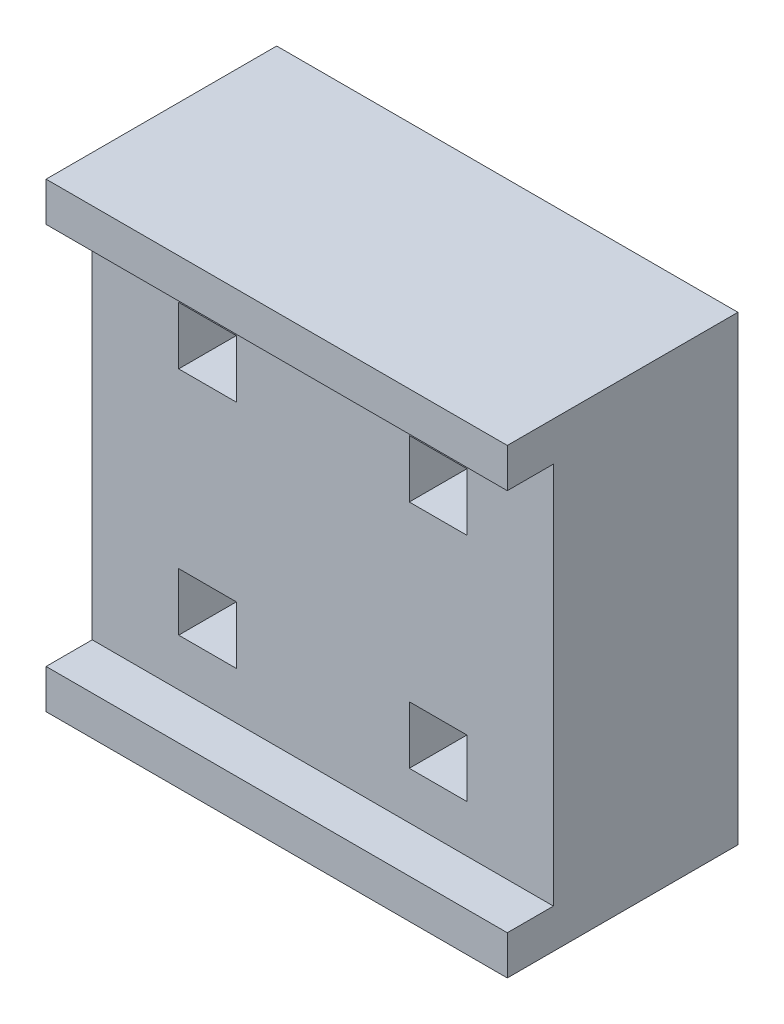
ISO-10303-21;
HEADER;
FILE_DESCRIPTION(('STEP AP214'),'2;1');
FILE_NAME('part.step','',(''),(''),'','','');
FILE_SCHEMA(('AUTOMOTIVE_DESIGN { 1 0 10303 214 1 1 1 1 }'));
ENDSEC;
DATA;
#1=APPLICATION_CONTEXT('core data for automotive mechanical design processes');
#2=APPLICATION_PROTOCOL_DEFINITION('international standard','automotive_design',2000,#1);
#3=PRODUCT_CONTEXT('',#1,'mechanical');
#4=PRODUCT('Part','Part','',(#3));
#5=PRODUCT_RELATED_PRODUCT_CATEGORY('part','',(#4));
#6=PRODUCT_DEFINITION_FORMATION('','',#4);
#7=PRODUCT_DEFINITION_CONTEXT('part definition',#1,'design');
#8=PRODUCT_DEFINITION('design','',#6,#7);
#9=PRODUCT_DEFINITION_SHAPE('','',#8);
#10=(LENGTH_UNIT() NAMED_UNIT(*) SI_UNIT(.MILLI.,.METRE.));
#11=(NAMED_UNIT(*) PLANE_ANGLE_UNIT() SI_UNIT($,.RADIAN.));
#12=(NAMED_UNIT(*) SI_UNIT($,.STERADIAN.) SOLID_ANGLE_UNIT());
#13=UNCERTAINTY_MEASURE_WITH_UNIT(LENGTH_MEASURE(1.E-05),#10,'distance_accuracy_value','');
#14=(GEOMETRIC_REPRESENTATION_CONTEXT(3) GLOBAL_UNCERTAINTY_ASSIGNED_CONTEXT((#13)) GLOBAL_UNIT_ASSIGNED_CONTEXT((#10,
#11,#12)) REPRESENTATION_CONTEXT('',''));
#15=CARTESIAN_POINT('',(0.,0.,0.));
#16=DIRECTION('',(0.,0.,1.));
#17=DIRECTION('',(1.,0.,0.));
#18=AXIS2_PLACEMENT_3D('',#15,#16,#17);
#19=CARTESIAN_POINT('',(0.000124023441458121,9.89966949484256E-05,6.33));
#20=DIRECTION('',(0.,-4.37113882867379E-08,1.));
#21=DIRECTION('',(0.,-1.,-4.37113882867379E-08));
#22=AXIS2_PLACEMENT_3D('',#19,#20,#21);
#23=PLANE('',#22);
#24=DIRECTION('',(1.,0.,0.));
#25=VECTOR('',#24,1.);
#26=CARTESIAN_POINT('',(-2.53987597655854,-2.10810100330505,6.32999990784765));
#27=LINE('',#26,#25);
#28=CARTESIAN_POINT('',(-2.53987597655854,-2.10810100330505,6.32999990784765));
#29=VERTEX_POINT('',#28);
#30=CARTESIAN_POINT('',(2.54012402344146,-2.10810100330505,6.32999990784765));
#31=VERTEX_POINT('',#30);
#32=EDGE_CURVE('E11',#29,#31,#27,.T.);
#33=ORIENTED_EDGE('',*,*,#32,.F.);
#34=DIRECTION('',(0.,-0.999999999999999,-4.37113882735736E-08));
#35=VECTOR('',#34,1.);
#36=CARTESIAN_POINT('',(-2.53987597655854,-2.10810100330505,6.32999990784765));
#37=LINE('',#36,#35);
#38=CARTESIAN_POINT('',(-2.53987597655854,-2.53990100330505,6.32999988897307));
#39=VERTEX_POINT('',#38);
#40=EDGE_CURVE('E368',#29,#39,#37,.T.);
#41=ORIENTED_EDGE('',*,*,#40,.T.);
#42=DIRECTION('',(1.,0.,0.));
#43=VECTOR('',#42,1.);
#44=CARTESIAN_POINT('',(-2.53987597655854,-2.53990100330505,6.32999988897307));
#45=LINE('',#44,#43);
#46=CARTESIAN_POINT('',(2.54012402344146,-2.53990100330505,6.32999988897307));
#47=VERTEX_POINT('',#46);
#48=EDGE_CURVE('E366',#39,#47,#45,.T.);
#49=ORIENTED_EDGE('',*,*,#48,.T.);
#50=DIRECTION('',(0.,0.999999999999999,4.37113882735736E-08));
#51=VECTOR('',#50,1.);
#52=CARTESIAN_POINT('',(2.54012402344146,-2.53990100330505,6.32999988897307));
#53=LINE('',#52,#51);
#54=EDGE_CURVE('E354',#47,#31,#53,.T.);
#55=ORIENTED_EDGE('',*,*,#54,.T.);
#56=EDGE_LOOP('',(#33,#41,#49,#55));
#57=FACE_BOUND('',#56,.T.);
#58=ADVANCED_FACE('F17',(#57),#23,.T.);
#59=CARTESIAN_POINT('',(-2.53987597655854,2.54009910772187,3.79000011102693));
#60=DIRECTION('',(-1.,0.,0.));
#61=DIRECTION('',(0.,-1.,-4.37113882867379E-08));
#62=AXIS2_PLACEMENT_3D('',#59,#60,#61);
#63=PLANE('',#62);
#64=DIRECTION('',(0.,4.37113897134182E-08,-0.999999999999999));
#65=VECTOR('',#64,1.);
#66=CARTESIAN_POINT('',(-2.53987597655854,-2.10810100330505,6.32999990784765));
#67=LINE('',#66,#65);
#68=CARTESIAN_POINT('',(-2.53987597655854,-2.10810098109967,5.82199990784765));
#69=VERTEX_POINT('',#68);
#70=EDGE_CURVE('E24',#29,#69,#67,.T.);
#71=ORIENTED_EDGE('',*,*,#70,.T.);
#72=DIRECTION('',(0.,0.999999999999999,4.37113881124894E-08));
#73=VECTOR('',#72,1.);
#74=CARTESIAN_POINT('',(-2.53987597655854,-2.10810098109967,5.82199990784765));
#75=LINE('',#74,#73);
#76=CARTESIAN_POINT('',(-2.53987597655854,2.10829901890033,5.82200009215235));
#77=VERTEX_POINT('',#76);
#78=EDGE_CURVE('E364',#69,#77,#75,.T.);
#79=ORIENTED_EDGE('',*,*,#78,.T.);
#80=DIRECTION('',(0.,-4.37113888392268E-08,0.999999999999999));
#81=VECTOR('',#80,1.);
#82=CARTESIAN_POINT('',(-2.53987597655854,2.10829901890033,5.82200009215235));
#83=LINE('',#82,#81);
#84=CARTESIAN_POINT('',(-2.53987597655854,2.10829899669495,6.33000009215235));
#85=VERTEX_POINT('',#84);
#86=EDGE_CURVE('E356',#77,#85,#83,.T.);
#87=ORIENTED_EDGE('',*,*,#86,.T.);
#88=DIRECTION('',(0.,-0.999999999999999,-4.37113882735736E-08));
#89=VECTOR('',#88,1.);
#90=CARTESIAN_POINT('',(-2.53987597655854,2.54009899669495,6.33000011102693));
#91=LINE('',#90,#89);
#92=CARTESIAN_POINT('',(-2.53987597655854,2.54009899669495,6.33000011102693));
#93=VERTEX_POINT('',#92);
#94=EDGE_CURVE('E347',#93,#85,#91,.T.);
#95=ORIENTED_EDGE('',*,*,#94,.F.);
#96=DIRECTION('',(0.,-4.3711388314712E-08,0.999999999999999));
#97=VECTOR('',#96,1.);
#98=CARTESIAN_POINT('',(-2.53987597655854,2.54009910772187,3.79000011102693));
#99=LINE('',#98,#97);
#100=CARTESIAN_POINT('',(-2.53987597655854,2.54009910772187,3.79000011102693));
#101=VERTEX_POINT('',#100);
#102=EDGE_CURVE('E337',#101,#93,#99,.T.);
#103=ORIENTED_EDGE('',*,*,#102,.F.);
#104=DIRECTION('',(0.,-0.999999999999999,-4.37113884895503E-08));
#105=VECTOR('',#104,1.);
#106=CARTESIAN_POINT('',(-2.53987597655854,2.54009910772187,3.79000011102693));
#107=LINE('',#106,#105);
#108=CARTESIAN_POINT('',(-2.53987597655854,-2.53990089227813,3.78999988897307));
#109=VERTEX_POINT('',#108);
#110=EDGE_CURVE('E324',#101,#109,#107,.T.);
#111=ORIENTED_EDGE('',*,*,#110,.T.);
#112=DIRECTION('',(0.,-4.3711388314712E-08,0.999999999999999));
#113=VECTOR('',#112,1.);
#114=CARTESIAN_POINT('',(-2.53987597655854,-2.53990089227813,3.78999988897307));
#115=LINE('',#114,#113);
#116=EDGE_CURVE('E358',#109,#39,#115,.T.);
#117=ORIENTED_EDGE('',*,*,#116,.T.);
#118=ORIENTED_EDGE('',*,*,#40,.F.);
#119=EDGE_LOOP('',(#71,#79,#87,#95,#103,#111,#117,#118));
#120=FACE_BOUND('',#119,.T.);
#121=ADVANCED_FACE('F374',(#120),#63,.T.);
#122=CARTESIAN_POINT('',(-2.53987597655854,-2.53990089227813,3.78999988897307));
#123=DIRECTION('',(0.,-1.,-4.37113882867379E-08));
#124=DIRECTION('',(1.,0.,0.));
#125=AXIS2_PLACEMENT_3D('',#122,#123,#124);
#126=PLANE('',#125);
#127=ORIENTED_EDGE('',*,*,#48,.F.);
#128=ORIENTED_EDGE('',*,*,#116,.F.);
#129=DIRECTION('',(1.,0.,0.));
#130=VECTOR('',#129,1.);
#131=CARTESIAN_POINT('',(-2.53987597655854,-2.53990089227813,3.78999988897307));
#132=LINE('',#131,#130);
#133=CARTESIAN_POINT('',(2.54012402344146,-2.53990089227813,3.78999988897307));
#134=VERTEX_POINT('',#133);
#135=EDGE_CURVE('E350',#109,#134,#132,.T.);
#136=ORIENTED_EDGE('',*,*,#135,.T.);
#137=DIRECTION('',(0.,-4.3711388314712E-08,0.999999999999999));
#138=VECTOR('',#137,1.);
#139=CARTESIAN_POINT('',(2.54012402344146,-2.53990089227813,3.78999988897307));
#140=LINE('',#139,#138);
#141=EDGE_CURVE('E340',#134,#47,#140,.T.);
#142=ORIENTED_EDGE('',*,*,#141,.T.);
#143=EDGE_LOOP('',(#127,#128,#136,#142));
#144=FACE_BOUND('',#143,.T.);
#145=ADVANCED_FACE('F372',(#144),#126,.T.);
#146=CARTESIAN_POINT('',(2.54012402344146,-2.53990089227813,3.78999988897307));
#147=DIRECTION('',(1.,0.,0.));
#148=DIRECTION('',(0.,1.,4.37113882867379E-08));
#149=AXIS2_PLACEMENT_3D('',#146,#147,#148);
#150=PLANE('',#149);
#151=DIRECTION('',(0.,4.37113897134182E-08,-0.999999999999999));
#152=VECTOR('',#151,1.);
#153=CARTESIAN_POINT('',(2.54012402344146,-2.10810100330505,6.32999990784765));
#154=LINE('',#153,#152);
#155=CARTESIAN_POINT('',(2.54012402344146,-2.10810098109967,5.82199990784765));
#156=VERTEX_POINT('',#155);
#157=EDGE_CURVE('E361',#31,#156,#154,.T.);
#158=ORIENTED_EDGE('',*,*,#157,.F.);
#159=ORIENTED_EDGE('',*,*,#54,.F.);
#160=ORIENTED_EDGE('',*,*,#141,.F.);
#161=DIRECTION('',(0.,0.999999999999999,4.37113881398737E-08));
#162=VECTOR('',#161,1.);
#163=CARTESIAN_POINT('',(2.54012402344146,-2.53990089227813,3.78999988897307));
#164=LINE('',#163,#162);
#165=CARTESIAN_POINT('',(2.54012402344146,2.54009910772187,3.79000011102693));
#166=VERTEX_POINT('',#165);
#167=EDGE_CURVE('E327',#134,#166,#164,.T.);
#168=ORIENTED_EDGE('',*,*,#167,.T.);
#169=DIRECTION('',(0.,-4.3711388314712E-08,0.999999999999999));
#170=VECTOR('',#169,1.);
#171=CARTESIAN_POINT('',(2.54012402344146,2.54009910772187,3.79000011102693));
#172=LINE('',#171,#170);
#173=CARTESIAN_POINT('',(2.54012402344146,2.54009899669495,6.33000011102693));
#174=VERTEX_POINT('',#173);
#175=EDGE_CURVE('E314',#166,#174,#172,.T.);
#176=ORIENTED_EDGE('',*,*,#175,.T.);
#177=DIRECTION('',(0.,0.999999999999999,4.37113882735736E-08));
#178=VECTOR('',#177,1.);
#179=CARTESIAN_POINT('',(2.54012402344146,2.10829899669495,6.33000009215235));
#180=LINE('',#179,#178);
#181=CARTESIAN_POINT('',(2.54012402344146,2.10829899669495,6.33000009215235));
#182=VERTEX_POINT('',#181);
#183=EDGE_CURVE('E304',#182,#174,#180,.T.);
#184=ORIENTED_EDGE('',*,*,#183,.F.);
#185=DIRECTION('',(0.,-4.37113888392268E-08,0.999999999999999));
#186=VECTOR('',#185,1.);
#187=CARTESIAN_POINT('',(2.54012402344146,2.10829901890033,5.82200009215235));
#188=LINE('',#187,#186);
#189=CARTESIAN_POINT('',(2.54012402344146,2.10829901890033,5.82200009215235));
#190=VERTEX_POINT('',#189);
#191=EDGE_CURVE('E290',#190,#182,#188,.T.);
#192=ORIENTED_EDGE('',*,*,#191,.F.);
#193=DIRECTION('',(0.,0.999999999999999,4.37113881124894E-08));
#194=VECTOR('',#193,1.);
#195=CARTESIAN_POINT('',(2.54012402344146,-2.10810098109967,5.82199990784765));
#196=LINE('',#195,#194);
#197=EDGE_CURVE('E279',#156,#190,#196,.T.);
#198=ORIENTED_EDGE('',*,*,#197,.F.);
#199=EDGE_LOOP('',(#158,#159,#160,#168,#176,#184,#192,#198));
#200=FACE_BOUND('',#199,.T.);
#201=ADVANCED_FACE('F382',(#200),#150,.T.);
#202=CARTESIAN_POINT('',(0.952624023441458,1.58759910772187,3.79000006939183));
#203=DIRECTION('',(-1.,0.,0.));
#204=DIRECTION('',(0.,-1.,-4.37113882867379E-08));
#205=AXIS2_PLACEMENT_3D('',#202,#203,#204);
#206=PLANE('',#205);
#207=DIRECTION('',(0.,-4.37113881835833E-08,0.999999999999999));
#208=VECTOR('',#207,1.);
#209=CARTESIAN_POINT('',(0.952624023441458,1.58759910772187,3.79000006939183));
#210=LINE('',#209,#208);
#211=CARTESIAN_POINT('',(0.952624023441458,1.58759910772187,3.79000006939183));
#212=VERTEX_POINT('',#211);
#213=CARTESIAN_POINT('',(0.952624023441458,1.58759901890033,5.82200006939183));
#214=VERTEX_POINT('',#213);
#215=EDGE_CURVE('E352',#212,#214,#210,.T.);
#216=ORIENTED_EDGE('',*,*,#215,.T.);
#217=DIRECTION('',(0.,-0.999999999999999,-4.37113890140651E-08));
#218=VECTOR('',#217,1.);
#219=CARTESIAN_POINT('',(0.952624023441458,1.58759901890033,5.82200006939183));
#220=LINE('',#219,#218);
#221=CARTESIAN_POINT('',(0.952624023441458,0.952599018900334,5.8220000416351));
#222=VERTEX_POINT('',#221);
#223=EDGE_CURVE('E343',#214,#222,#220,.T.);
#224=ORIENTED_EDGE('',*,*,#223,.T.);
#225=DIRECTION('',(0.,-4.37113882928572E-08,0.999999999999999));
#226=VECTOR('',#225,1.);
#227=CARTESIAN_POINT('',(0.952624023441458,0.952599107721875,3.7900000416351));
#228=LINE('',#227,#226);
#229=CARTESIAN_POINT('',(0.952624023441458,0.952599107721875,3.7900000416351));
#230=VERTEX_POINT('',#229);
#231=EDGE_CURVE('E329',#230,#222,#228,.T.);
#232=ORIENTED_EDGE('',*,*,#231,.F.);
#233=DIRECTION('',(0.,-0.999999999999999,-4.3711388314712E-08));
#234=VECTOR('',#233,1.);
#235=CARTESIAN_POINT('',(0.952624023441458,1.58759910772187,3.79000006939183));
#236=LINE('',#235,#234);
#237=EDGE_CURVE('E316',#212,#230,#236,.T.);
#238=ORIENTED_EDGE('',*,*,#237,.F.);
#239=EDGE_LOOP('',(#216,#224,#232,#238));
#240=FACE_BOUND('',#239,.T.);
#241=ADVANCED_FACE('F426',(#240),#206,.F.);
#242=CARTESIAN_POINT('',(1.58762402344146,1.58759910772187,3.79000006939183));
#243=DIRECTION('',(0.,1.,4.37113882867379E-08));
#244=DIRECTION('',(-1.,0.,0.));
#245=AXIS2_PLACEMENT_3D('',#242,#243,#244);
#246=PLANE('',#245);
#247=DIRECTION('',(0.,-4.37113881835833E-08,0.999999999999999));
#248=VECTOR('',#247,1.);
#249=CARTESIAN_POINT('',(1.58762402344146,1.58759910772187,3.79000006939183));
#250=LINE('',#249,#248);
#251=CARTESIAN_POINT('',(1.58762402344146,1.58759910772187,3.79000006939183));
#252=VERTEX_POINT('',#251);
#253=CARTESIAN_POINT('',(1.58762402344146,1.58759901890033,5.82200006939183));
#254=VERTEX_POINT('',#253);
#255=EDGE_CURVE('E345',#252,#254,#250,.T.);
#256=ORIENTED_EDGE('',*,*,#255,.T.);
#257=DIRECTION('',(-1.,0.,0.));
#258=VECTOR('',#257,1.);
#259=CARTESIAN_POINT('',(1.58762402344146,1.58759901890033,5.82200006939183));
#260=LINE('',#259,#258);
#261=EDGE_CURVE('E332',#254,#214,#260,.T.);
#262=ORIENTED_EDGE('',*,*,#261,.T.);
#263=ORIENTED_EDGE('',*,*,#215,.F.);
#264=DIRECTION('',(-1.,0.,0.));
#265=VECTOR('',#264,1.);
#266=CARTESIAN_POINT('',(1.58762402344146,1.58759910772187,3.79000006939183));
#267=LINE('',#266,#265);
#268=EDGE_CURVE('E307',#252,#212,#267,.T.);
#269=ORIENTED_EDGE('',*,*,#268,.F.);
#270=EDGE_LOOP('',(#256,#262,#263,#269));
#271=FACE_BOUND('',#270,.T.);
#272=ADVANCED_FACE('F431',(#271),#246,.F.);
#273=CARTESIAN_POINT('',(1.58762402344146,0.952599107721875,3.7900000416351));
#274=DIRECTION('',(1.,0.,0.));
#275=DIRECTION('',(0.,1.,4.37113882867379E-08));
#276=AXIS2_PLACEMENT_3D('',#273,#274,#275);
#277=PLANE('',#276);
#278=DIRECTION('',(0.,-4.37113882928572E-08,0.999999999999999));
#279=VECTOR('',#278,1.);
#280=CARTESIAN_POINT('',(1.58762402344146,0.952599107721875,3.7900000416351));
#281=LINE('',#280,#279);
#282=CARTESIAN_POINT('',(1.58762402344146,0.952599107721875,3.7900000416351));
#283=VERTEX_POINT('',#282);
#284=CARTESIAN_POINT('',(1.58762402344146,0.952599018900334,5.8220000416351));
#285=VERTEX_POINT('',#284);
#286=EDGE_CURVE('E335',#283,#285,#281,.T.);
#287=ORIENTED_EDGE('',*,*,#286,.T.);
#288=DIRECTION('',(0.,0.999999999999999,4.37113890140651E-08));
#289=VECTOR('',#288,1.);
#290=CARTESIAN_POINT('',(1.58762402344146,0.952599018900334,5.8220000416351));
#291=LINE('',#290,#289);
#292=EDGE_CURVE('E319',#285,#254,#291,.T.);
#293=ORIENTED_EDGE('',*,*,#292,.T.);
#294=ORIENTED_EDGE('',*,*,#255,.F.);
#295=DIRECTION('',(0.,0.999999999999999,4.3711388314712E-08));
#296=VECTOR('',#295,1.);
#297=CARTESIAN_POINT('',(1.58762402344146,0.952599107721875,3.7900000416351));
#298=LINE('',#297,#296);
#299=EDGE_CURVE('E293',#283,#252,#298,.T.);
#300=ORIENTED_EDGE('',*,*,#299,.F.);
#301=EDGE_LOOP('',(#287,#293,#294,#300));
#302=FACE_BOUND('',#301,.T.);
#303=ADVANCED_FACE('F436',(#302),#277,.F.);
#304=CARTESIAN_POINT('',(0.952624023441458,-0.952400892278125,3.7899999583649));
#305=DIRECTION('',(-1.,0.,0.));
#306=DIRECTION('',(0.,-1.,-4.37113882867379E-08));
#307=AXIS2_PLACEMENT_3D('',#304,#305,#306);
#308=PLANE('',#307);
#309=DIRECTION('',(0.,-4.37113882928572E-08,0.999999999999999));
#310=VECTOR('',#309,1.);
#311=CARTESIAN_POINT('',(0.952624023441458,-0.952400892278125,3.7899999583649));
#312=LINE('',#311,#310);
#313=CARTESIAN_POINT('',(0.952624023441458,-0.952400892278125,3.7899999583649));
#314=VERTEX_POINT('',#313);
#315=CARTESIAN_POINT('',(0.952624023441458,-0.952400981099666,5.8219999583649));
#316=VERTEX_POINT('',#315);
#317=EDGE_CURVE('E322',#314,#316,#312,.T.);
#318=ORIENTED_EDGE('',*,*,#317,.T.);
#319=DIRECTION('',(0.,-0.999999999999999,-4.37113890140651E-08));
#320=VECTOR('',#319,1.);
#321=CARTESIAN_POINT('',(0.952624023441458,-0.952400981099666,5.8219999583649));
#322=LINE('',#321,#320);
#323=CARTESIAN_POINT('',(0.952624023441458,-1.58740098109967,5.82199993060817));
#324=VERTEX_POINT('',#323);
#325=EDGE_CURVE('E310',#316,#324,#322,.T.);
#326=ORIENTED_EDGE('',*,*,#325,.T.);
#327=DIRECTION('',(0.,-4.37113884021311E-08,0.999999999999999));
#328=VECTOR('',#327,1.);
#329=CARTESIAN_POINT('',(0.952624023441458,-1.58740089227813,3.78999993060817));
#330=LINE('',#329,#328);
#331=CARTESIAN_POINT('',(0.952624023441458,-1.58740089227813,3.78999993060817));
#332=VERTEX_POINT('',#331);
#333=EDGE_CURVE('E296',#332,#324,#330,.T.);
#334=ORIENTED_EDGE('',*,*,#333,.F.);
#335=DIRECTION('',(0.,-0.999999999999999,-4.3711388314712E-08));
#336=VECTOR('',#335,1.);
#337=CARTESIAN_POINT('',(0.952624023441458,-0.952400892278125,3.7899999583649));
#338=LINE('',#337,#336);
#339=EDGE_CURVE('E282',#314,#332,#338,.T.);
#340=ORIENTED_EDGE('',*,*,#339,.F.);
#341=EDGE_LOOP('',(#318,#326,#334,#340));
#342=FACE_BOUND('',#341,.T.);
#343=ADVANCED_FACE('F441',(#342),#308,.F.);
#344=CARTESIAN_POINT('',(1.58762402344146,-0.952400892278125,3.7899999583649));
#345=DIRECTION('',(0.,1.,4.37113882867379E-08));
#346=DIRECTION('',(-1.,0.,0.));
#347=AXIS2_PLACEMENT_3D('',#344,#345,#346);
#348=PLANE('',#347);
#349=DIRECTION('',(0.,-4.37113882928572E-08,0.999999999999999));
#350=VECTOR('',#349,1.);
#351=CARTESIAN_POINT('',(1.58762402344146,-0.952400892278125,3.7899999583649));
#352=LINE('',#351,#350);
#353=CARTESIAN_POINT('',(1.58762402344146,-0.952400892278125,3.7899999583649));
#354=VERTEX_POINT('',#353);
#355=CARTESIAN_POINT('',(1.58762402344146,-0.952400981099666,5.8219999583649));
#356=VERTEX_POINT('',#355);
#357=EDGE_CURVE('E312',#354,#356,#352,.T.);
#358=ORIENTED_EDGE('',*,*,#357,.T.);
#359=DIRECTION('',(-1.,0.,0.));
#360=VECTOR('',#359,1.);
#361=CARTESIAN_POINT('',(1.58762402344146,-0.952400981099666,5.8219999583649));
#362=LINE('',#361,#360);
#363=EDGE_CURVE('E299',#356,#316,#362,.T.);
#364=ORIENTED_EDGE('',*,*,#363,.T.);
#365=ORIENTED_EDGE('',*,*,#317,.F.);
#366=DIRECTION('',(-1.,0.,0.));
#367=VECTOR('',#366,1.);
#368=CARTESIAN_POINT('',(1.58762402344146,-0.952400892278125,3.7899999583649));
#369=LINE('',#368,#367);
#370=EDGE_CURVE('E272',#354,#314,#369,.T.);
#371=ORIENTED_EDGE('',*,*,#370,.F.);
#372=EDGE_LOOP('',(#358,#364,#365,#371));
#373=FACE_BOUND('',#372,.T.);
#374=ADVANCED_FACE('F446',(#373),#348,.F.);
#375=CARTESIAN_POINT('',(1.58762402344146,-1.58740089227813,3.78999993060817));
#376=DIRECTION('',(1.,0.,0.));
#377=DIRECTION('',(0.,1.,4.37113882867379E-08));
#378=AXIS2_PLACEMENT_3D('',#375,#376,#377);
#379=PLANE('',#378);
#380=DIRECTION('',(0.,-4.37113884021311E-08,0.999999999999999));
#381=VECTOR('',#380,1.);
#382=CARTESIAN_POINT('',(1.58762402344146,-1.58740089227813,3.78999993060817));
#383=LINE('',#382,#381);
#384=CARTESIAN_POINT('',(1.58762402344146,-1.58740089227813,3.78999993060817));
#385=VERTEX_POINT('',#384);
#386=CARTESIAN_POINT('',(1.58762402344146,-1.58740098109967,5.82199993060817));
#387=VERTEX_POINT('',#386);
#388=EDGE_CURVE('E302',#385,#387,#383,.T.);
#389=ORIENTED_EDGE('',*,*,#388,.T.);
#390=DIRECTION('',(0.,0.999999999999999,4.37113890140651E-08));
#391=VECTOR('',#390,1.);
#392=CARTESIAN_POINT('',(1.58762402344146,-1.58740098109967,5.82199993060817));
#393=LINE('',#392,#391);
#394=EDGE_CURVE('E285',#387,#356,#393,.T.);
#395=ORIENTED_EDGE('',*,*,#394,.T.);
#396=ORIENTED_EDGE('',*,*,#357,.F.);
#397=DIRECTION('',(0.,0.999999999999999,4.3711388314712E-08));
#398=VECTOR('',#397,1.);
#399=CARTESIAN_POINT('',(1.58762402344146,-1.58740089227813,3.78999993060817));
#400=LINE('',#399,#398);
#401=EDGE_CURVE('E261',#385,#354,#400,.T.);
#402=ORIENTED_EDGE('',*,*,#401,.F.);
#403=EDGE_LOOP('',(#389,#395,#396,#402));
#404=FACE_BOUND('',#403,.T.);
#405=ADVANCED_FACE('F474',(#404),#379,.F.);
#406=CARTESIAN_POINT('',(-1.58737597655854,1.58759910772187,3.79000006939183));
#407=DIRECTION('',(-1.,0.,0.));
#408=DIRECTION('',(0.,-1.,-4.37113882867379E-08));
#409=AXIS2_PLACEMENT_3D('',#406,#407,#408);
#410=PLANE('',#409);
#411=DIRECTION('',(0.,-4.37113881835833E-08,0.999999999999999));
#412=VECTOR('',#411,1.);
#413=CARTESIAN_POINT('',(-1.58737597655854,1.58759910772187,3.79000006939183));
#414=LINE('',#413,#412);
#415=CARTESIAN_POINT('',(-1.58737597655854,1.58759910772187,3.79000006939183));
#416=VERTEX_POINT('',#415);
#417=CARTESIAN_POINT('',(-1.58737597655854,1.58759901890033,5.82200006939183));
#418=VERTEX_POINT('',#417);
#419=EDGE_CURVE('E288',#416,#418,#414,.T.);
#420=ORIENTED_EDGE('',*,*,#419,.T.);
#421=DIRECTION('',(0.,-0.999999999999999,-4.37113890140651E-08));
#422=VECTOR('',#421,1.);
#423=CARTESIAN_POINT('',(-1.58737597655854,1.58759901890033,5.82200006939183));
#424=LINE('',#423,#422);
#425=CARTESIAN_POINT('',(-1.58737597655854,0.952599018900334,5.8220000416351));
#426=VERTEX_POINT('',#425);
#427=EDGE_CURVE('E275',#418,#426,#424,.T.);
#428=ORIENTED_EDGE('',*,*,#427,.T.);
#429=DIRECTION('',(0.,-4.37113882928572E-08,0.999999999999999));
#430=VECTOR('',#429,1.);
#431=CARTESIAN_POINT('',(-1.58737597655854,0.952599107721875,3.7900000416351));
#432=LINE('',#431,#430);
#433=CARTESIAN_POINT('',(-1.58737597655854,0.952599107721875,3.7900000416351));
#434=VERTEX_POINT('',#433);
#435=EDGE_CURVE('E264',#434,#426,#432,.T.);
#436=ORIENTED_EDGE('',*,*,#435,.F.);
#437=DIRECTION('',(0.,-0.999999999999999,-4.3711388314712E-08));
#438=VECTOR('',#437,1.);
#439=CARTESIAN_POINT('',(-1.58737597655854,1.58759910772187,3.79000006939183));
#440=LINE('',#439,#438);
#441=EDGE_CURVE('E253',#416,#434,#440,.T.);
#442=ORIENTED_EDGE('',*,*,#441,.F.);
#443=EDGE_LOOP('',(#420,#428,#436,#442));
#444=FACE_BOUND('',#443,.T.);
#445=ADVANCED_FACE('F478',(#444),#410,.F.);
#446=CARTESIAN_POINT('',(-0.952375976558542,1.58759910772187,3.79000006939183));
#447=DIRECTION('',(0.,1.,4.37113882867379E-08));
#448=DIRECTION('',(-1.,0.,0.));
#449=AXIS2_PLACEMENT_3D('',#446,#447,#448);
#450=PLANE('',#449);
#451=DIRECTION('',(0.,-4.37113881835833E-08,0.999999999999999));
#452=VECTOR('',#451,1.);
#453=CARTESIAN_POINT('',(-0.952375976558542,1.58759910772187,3.79000006939183));
#454=LINE('',#453,#452);
#455=CARTESIAN_POINT('',(-0.952375976558542,1.58759910772187,3.79000006939183));
#456=VERTEX_POINT('',#455);
#457=CARTESIAN_POINT('',(-0.952375976558542,1.58759901890033,5.82200006939183));
#458=VERTEX_POINT('',#457);
#459=EDGE_CURVE('E277',#456,#458,#454,.T.);
#460=ORIENTED_EDGE('',*,*,#459,.T.);
#461=DIRECTION('',(-1.,0.,0.));
#462=VECTOR('',#461,1.);
#463=CARTESIAN_POINT('',(-0.952375976558542,1.58759901890033,5.82200006939183));
#464=LINE('',#463,#462);
#465=EDGE_CURVE('E267',#458,#418,#464,.T.);
#466=ORIENTED_EDGE('',*,*,#465,.T.);
#467=ORIENTED_EDGE('',*,*,#419,.F.);
#468=DIRECTION('',(-1.,0.,0.));
#469=VECTOR('',#468,1.);
#470=CARTESIAN_POINT('',(-0.952375976558542,1.58759910772187,3.79000006939183));
#471=LINE('',#470,#469);
#472=EDGE_CURVE('E197',#456,#416,#471,.T.);
#473=ORIENTED_EDGE('',*,*,#472,.F.);
#474=EDGE_LOOP('',(#460,#466,#467,#473));
#475=FACE_BOUND('',#474,.T.);
#476=ADVANCED_FACE('F481',(#475),#450,.F.);
#477=CARTESIAN_POINT('',(-0.952375976558542,0.952599107721875,3.7900000416351));
#478=DIRECTION('',(1.,0.,0.));
#479=DIRECTION('',(0.,1.,4.37113882867379E-08));
#480=AXIS2_PLACEMENT_3D('',#477,#478,#479);
#481=PLANE('',#480);
#482=DIRECTION('',(0.,-4.37113882928572E-08,0.999999999999999));
#483=VECTOR('',#482,1.);
#484=CARTESIAN_POINT('',(-0.952375976558542,0.952599107721875,3.7900000416351));
#485=LINE('',#484,#483);
#486=CARTESIAN_POINT('',(-0.952375976558542,0.952599107721875,3.7900000416351));
#487=VERTEX_POINT('',#486);
#488=CARTESIAN_POINT('',(-0.952375976558542,0.952599018900334,5.8220000416351));
#489=VERTEX_POINT('',#488);
#490=EDGE_CURVE('E270',#487,#489,#485,.T.);
#491=ORIENTED_EDGE('',*,*,#490,.T.);
#492=DIRECTION('',(0.,0.999999999999999,4.37113890140651E-08));
#493=VECTOR('',#492,1.);
#494=CARTESIAN_POINT('',(-0.952375976558542,0.952599018900334,5.8220000416351));
#495=LINE('',#494,#493);
#496=EDGE_CURVE('E256',#489,#458,#495,.T.);
#497=ORIENTED_EDGE('',*,*,#496,.T.);
#498=ORIENTED_EDGE('',*,*,#459,.F.);
#499=DIRECTION('',(0.,0.999999999999999,4.3711388314712E-08));
#500=VECTOR('',#499,1.);
#501=CARTESIAN_POINT('',(-0.952375976558542,0.952599107721875,3.7900000416351));
#502=LINE('',#501,#500);
#503=EDGE_CURVE('E241',#487,#456,#502,.T.);
#504=ORIENTED_EDGE('',*,*,#503,.F.);
#505=EDGE_LOOP('',(#491,#497,#498,#504));
#506=FACE_BOUND('',#505,.T.);
#507=ADVANCED_FACE('F486',(#506),#481,.F.);
#508=CARTESIAN_POINT('',(-1.58737597655854,-0.952400892278125,3.7899999583649));
#509=DIRECTION('',(-1.,0.,0.));
#510=DIRECTION('',(0.,-1.,-4.37113882867379E-08));
#511=AXIS2_PLACEMENT_3D('',#508,#509,#510);
#512=PLANE('',#511);
#513=DIRECTION('',(0.,-4.37113882928572E-08,0.999999999999999));
#514=VECTOR('',#513,1.);
#515=CARTESIAN_POINT('',(-1.58737597655854,-0.952400892278125,3.7899999583649));
#516=LINE('',#515,#514);
#517=CARTESIAN_POINT('',(-1.58737597655854,-0.952400892278125,3.7899999583649));
#518=VERTEX_POINT('',#517);
#519=CARTESIAN_POINT('',(-1.58737597655854,-0.952400981099666,5.8219999583649));
#520=VERTEX_POINT('',#519);
#521=EDGE_CURVE('E259',#518,#520,#516,.T.);
#522=ORIENTED_EDGE('',*,*,#521,.T.);
#523=DIRECTION('',(0.,-0.999999999999999,-4.37113890140651E-08));
#524=VECTOR('',#523,1.);
#525=CARTESIAN_POINT('',(-1.58737597655854,-0.952400981099666,5.8219999583649));
#526=LINE('',#525,#524);
#527=CARTESIAN_POINT('',(-1.58737597655854,-1.58740098109967,5.82199993060817));
#528=VERTEX_POINT('',#527);
#529=EDGE_CURVE('E250',#520,#528,#526,.T.);
#530=ORIENTED_EDGE('',*,*,#529,.T.);
#531=DIRECTION('',(0.,-4.37113884021311E-08,0.999999999999999));
#532=VECTOR('',#531,1.);
#533=CARTESIAN_POINT('',(-1.58737597655854,-1.58740089227813,3.78999993060817));
#534=LINE('',#533,#532);
#535=CARTESIAN_POINT('',(-1.58737597655854,-1.58740089227813,3.78999993060817));
#536=VERTEX_POINT('',#535);
#537=EDGE_CURVE('E244',#536,#528,#534,.T.);
#538=ORIENTED_EDGE('',*,*,#537,.F.);
#539=DIRECTION('',(0.,-0.999999999999999,-4.3711388314712E-08));
#540=VECTOR('',#539,1.);
#541=CARTESIAN_POINT('',(-1.58737597655854,-0.952400892278125,3.7899999583649));
#542=LINE('',#541,#540);
#543=EDGE_CURVE('E202',#518,#536,#542,.T.);
#544=ORIENTED_EDGE('',*,*,#543,.F.);
#545=EDGE_LOOP('',(#522,#530,#538,#544));
#546=FACE_BOUND('',#545,.T.);
#547=ADVANCED_FACE('F490',(#546),#512,.F.);
#548=CARTESIAN_POINT('',(-0.952375976558542,-0.952400892278125,3.7899999583649));
#549=DIRECTION('',(0.,1.,4.37113882867379E-08));
#550=DIRECTION('',(-1.,0.,0.));
#551=AXIS2_PLACEMENT_3D('',#548,#549,#550);
#552=PLANE('',#551);
#553=DIRECTION('',(0.,-4.37113882928572E-08,0.999999999999999));
#554=VECTOR('',#553,1.);
#555=CARTESIAN_POINT('',(-0.952375976558542,-0.952400892278125,3.7899999583649));
#556=LINE('',#555,#554);
#557=CARTESIAN_POINT('',(-0.952375976558542,-0.952400892278125,3.7899999583649));
#558=VERTEX_POINT('',#557);
#559=CARTESIAN_POINT('',(-0.952375976558542,-0.952400981099666,5.8219999583649));
#560=VERTEX_POINT('',#559);
#561=EDGE_CURVE('E180',#558,#560,#556,.T.);
#562=ORIENTED_EDGE('',*,*,#561,.T.);
#563=DIRECTION('',(-1.,0.,0.));
#564=VECTOR('',#563,1.);
#565=CARTESIAN_POINT('',(-0.952375976558542,-0.952400981099666,5.8219999583649));
#566=LINE('',#565,#564);
#567=EDGE_CURVE('E198',#560,#520,#566,.T.);
#568=ORIENTED_EDGE('',*,*,#567,.T.);
#569=ORIENTED_EDGE('',*,*,#521,.F.);
#570=DIRECTION('',(-1.,0.,0.));
#571=VECTOR('',#570,1.);
#572=CARTESIAN_POINT('',(-0.952375976558542,-0.952400892278125,3.7899999583649));
#573=LINE('',#572,#571);
#574=EDGE_CURVE('E233',#558,#518,#573,.T.);
#575=ORIENTED_EDGE('',*,*,#574,.F.);
#576=EDGE_LOOP('',(#562,#568,#569,#575));
#577=FACE_BOUND('',#576,.T.);
#578=ADVANCED_FACE('F469',(#577),#552,.F.);
#579=CARTESIAN_POINT('',(-0.952375976558542,-1.58740089227813,3.78999993060817));
#580=DIRECTION('',(1.,0.,0.));
#581=DIRECTION('',(0.,1.,4.37113882867379E-08));
#582=AXIS2_PLACEMENT_3D('',#579,#580,#581);
#583=PLANE('',#582);
#584=DIRECTION('',(0.,-4.37113884021311E-08,0.999999999999999));
#585=VECTOR('',#584,1.);
#586=CARTESIAN_POINT('',(-0.952375976558542,-1.58740089227813,3.78999993060817));
#587=LINE('',#586,#585);
#588=CARTESIAN_POINT('',(-0.952375976558542,-1.58740089227813,3.78999993060817));
#589=VERTEX_POINT('',#588);
#590=CARTESIAN_POINT('',(-0.952375976558542,-1.58740098109967,5.82199993060817));
#591=VERTEX_POINT('',#590);
#592=EDGE_CURVE('E178',#589,#591,#587,.T.);
#593=ORIENTED_EDGE('',*,*,#592,.T.);
#594=DIRECTION('',(0.,0.999999999999999,4.37113890140651E-08));
#595=VECTOR('',#594,1.);
#596=CARTESIAN_POINT('',(-0.952375976558542,-1.58740098109967,5.82199993060817));
#597=LINE('',#596,#595);
#598=EDGE_CURVE('E239',#591,#560,#597,.T.);
#599=ORIENTED_EDGE('',*,*,#598,.T.);
#600=ORIENTED_EDGE('',*,*,#561,.F.);
#601=DIRECTION('',(0.,0.999999999999999,4.3711388314712E-08));
#602=VECTOR('',#601,1.);
#603=CARTESIAN_POINT('',(-0.952375976558542,-1.58740089227813,3.78999993060817));
#604=LINE('',#603,#602);
#605=EDGE_CURVE('E174',#589,#558,#604,.T.);
#606=ORIENTED_EDGE('',*,*,#605,.F.);
#607=EDGE_LOOP('',(#593,#599,#600,#606));
#608=FACE_BOUND('',#607,.T.);
#609=ADVANCED_FACE('F176',(#608),#583,.F.);
#610=CARTESIAN_POINT('',(0.952624023441458,0.952599107721875,3.7900000416351));
#611=DIRECTION('',(0.,-1.,-4.37113882867379E-08));
#612=DIRECTION('',(1.,0.,0.));
#613=AXIS2_PLACEMENT_3D('',#610,#611,#612);
#614=PLANE('',#613);
#615=ORIENTED_EDGE('',*,*,#231,.T.);
#616=DIRECTION('',(1.,0.,0.));
#617=VECTOR('',#616,1.);
#618=CARTESIAN_POINT('',(0.952624023441458,0.952599018900334,5.8220000416351));
#619=LINE('',#618,#617);
#620=EDGE_CURVE('E235',#222,#285,#619,.T.);
#621=ORIENTED_EDGE('',*,*,#620,.T.);
#622=ORIENTED_EDGE('',*,*,#286,.F.);
#623=DIRECTION('',(1.,0.,0.));
#624=VECTOR('',#623,1.);
#625=CARTESIAN_POINT('',(0.952624023441458,0.952599107721875,3.7900000416351));
#626=LINE('',#625,#624);
#627=EDGE_CURVE('E226',#230,#283,#626,.T.);
#628=ORIENTED_EDGE('',*,*,#627,.F.);
#629=EDGE_LOOP('',(#615,#621,#622,#628));
#630=FACE_BOUND('',#629,.T.);
#631=ADVANCED_FACE('F454',(#630),#614,.F.);
#632=CARTESIAN_POINT('',(0.952624023441458,-1.58740089227813,3.78999993060817));
#633=DIRECTION('',(0.,-1.,-4.37113882867379E-08));
#634=DIRECTION('',(1.,0.,0.));
#635=AXIS2_PLACEMENT_3D('',#632,#633,#634);
#636=PLANE('',#635);
#637=ORIENTED_EDGE('',*,*,#333,.T.);
#638=DIRECTION('',(1.,0.,0.));
#639=VECTOR('',#638,1.);
#640=CARTESIAN_POINT('',(0.952624023441458,-1.58740098109967,5.82199993060817));
#641=LINE('',#640,#639);
#642=EDGE_CURVE('E185',#324,#387,#641,.T.);
#643=ORIENTED_EDGE('',*,*,#642,.T.);
#644=ORIENTED_EDGE('',*,*,#388,.F.);
#645=DIRECTION('',(1.,0.,0.));
#646=VECTOR('',#645,1.);
#647=CARTESIAN_POINT('',(0.952624023441458,-1.58740089227813,3.78999993060817));
#648=LINE('',#647,#646);
#649=EDGE_CURVE('E219',#332,#385,#648,.T.);
#650=ORIENTED_EDGE('',*,*,#649,.F.);
#651=EDGE_LOOP('',(#637,#643,#644,#650));
#652=FACE_BOUND('',#651,.T.);
#653=ADVANCED_FACE('F461',(#652),#636,.F.);
#654=CARTESIAN_POINT('',(-1.58737597655854,0.952599107721875,3.7900000416351));
#655=DIRECTION('',(0.,-1.,-4.37113882867379E-08));
#656=DIRECTION('',(1.,0.,0.));
#657=AXIS2_PLACEMENT_3D('',#654,#655,#656);
#658=PLANE('',#657);
#659=ORIENTED_EDGE('',*,*,#435,.T.);
#660=DIRECTION('',(1.,0.,0.));
#661=VECTOR('',#660,1.);
#662=CARTESIAN_POINT('',(-1.58737597655854,0.952599018900334,5.8220000416351));
#663=LINE('',#662,#661);
#664=EDGE_CURVE('E186',#426,#489,#663,.T.);
#665=ORIENTED_EDGE('',*,*,#664,.T.);
#666=ORIENTED_EDGE('',*,*,#490,.F.);
#667=DIRECTION('',(1.,0.,0.));
#668=VECTOR('',#667,1.);
#669=CARTESIAN_POINT('',(-1.58737597655854,0.952599107721875,3.7900000416351));
#670=LINE('',#669,#668);
#671=EDGE_CURVE('E216',#434,#487,#670,.T.);
#672=ORIENTED_EDGE('',*,*,#671,.F.);
#673=EDGE_LOOP('',(#659,#665,#666,#672));
#674=FACE_BOUND('',#673,.T.);
#675=ADVANCED_FACE('F409',(#674),#658,.F.);
#676=CARTESIAN_POINT('',(-1.58737597655854,-1.58740089227813,3.78999993060817));
#677=DIRECTION('',(0.,-1.,-4.37113882867379E-08));
#678=DIRECTION('',(1.,0.,0.));
#679=AXIS2_PLACEMENT_3D('',#676,#677,#678);
#680=PLANE('',#679);
#681=ORIENTED_EDGE('',*,*,#537,.T.);
#682=DIRECTION('',(1.,0.,0.));
#683=VECTOR('',#682,1.);
#684=CARTESIAN_POINT('',(-1.58737597655854,-1.58740098109967,5.82199993060817));
#685=LINE('',#684,#683);
#686=EDGE_CURVE('E195',#528,#591,#685,.T.);
#687=ORIENTED_EDGE('',*,*,#686,.T.);
#688=ORIENTED_EDGE('',*,*,#592,.F.);
#689=DIRECTION('',(1.,0.,0.));
#690=VECTOR('',#689,1.);
#691=CARTESIAN_POINT('',(-1.58737597655854,-1.58740089227813,3.78999993060817));
#692=LINE('',#691,#690);
#693=EDGE_CURVE('E192',#536,#589,#692,.T.);
#694=ORIENTED_EDGE('',*,*,#693,.F.);
#695=EDGE_LOOP('',(#681,#687,#688,#694));
#696=FACE_BOUND('',#695,.T.);
#697=ADVANCED_FACE('F191',(#696),#680,.F.);
#698=CARTESIAN_POINT('',(2.54012402344146,2.54009910772187,3.79000011102693));
#699=DIRECTION('',(0.,1.,4.37113882867379E-08));
#700=DIRECTION('',(-1.,0.,0.));
#701=AXIS2_PLACEMENT_3D('',#698,#699,#700);
#702=PLANE('',#701);
#703=DIRECTION('',(-1.,0.,0.));
#704=VECTOR('',#703,1.);
#705=CARTESIAN_POINT('',(2.54012402344146,2.54009899669495,6.33000011102693));
#706=LINE('',#705,#704);
#707=EDGE_CURVE('E223',#174,#93,#706,.T.);
#708=ORIENTED_EDGE('',*,*,#707,.F.);
#709=ORIENTED_EDGE('',*,*,#175,.F.);
#710=DIRECTION('',(-1.,0.,0.));
#711=VECTOR('',#710,1.);
#712=CARTESIAN_POINT('',(2.54012402344146,2.54009910772187,3.79000011102693));
#713=LINE('',#712,#711);
#714=EDGE_CURVE('E203',#166,#101,#713,.T.);
#715=ORIENTED_EDGE('',*,*,#714,.T.);
#716=ORIENTED_EDGE('',*,*,#102,.T.);
#717=EDGE_LOOP('',(#708,#709,#715,#716));
#718=FACE_BOUND('',#717,.T.);
#719=ADVANCED_FACE('F400',(#718),#702,.T.);
#720=CARTESIAN_POINT('',(0.000124023441458121,9.91077218746739E-05,3.79));
#721=DIRECTION('',(0.,-4.37113882867379E-08,1.));
#722=DIRECTION('',(0.,-1.,-4.37113882867379E-08));
#723=AXIS2_PLACEMENT_3D('',#720,#721,#722);
#724=PLANE('',#723);
#725=ORIENTED_EDGE('',*,*,#110,.F.);
#726=ORIENTED_EDGE('',*,*,#714,.F.);
#727=ORIENTED_EDGE('',*,*,#167,.F.);
#728=ORIENTED_EDGE('',*,*,#135,.F.);
#729=EDGE_LOOP('',(#725,#726,#727,#728));
#730=FACE_BOUND('',#729,.T.);
#731=ORIENTED_EDGE('',*,*,#441,.T.);
#732=ORIENTED_EDGE('',*,*,#671,.T.);
#733=ORIENTED_EDGE('',*,*,#503,.T.);
#734=ORIENTED_EDGE('',*,*,#472,.T.);
#735=EDGE_LOOP('',(#731,#732,#733,#734));
#736=FACE_BOUND('',#735,.T.);
#737=ORIENTED_EDGE('',*,*,#339,.T.);
#738=ORIENTED_EDGE('',*,*,#649,.T.);
#739=ORIENTED_EDGE('',*,*,#401,.T.);
#740=ORIENTED_EDGE('',*,*,#370,.T.);
#741=EDGE_LOOP('',(#737,#738,#739,#740));
#742=FACE_BOUND('',#741,.T.);
#743=ORIENTED_EDGE('',*,*,#237,.T.);
#744=ORIENTED_EDGE('',*,*,#627,.T.);
#745=ORIENTED_EDGE('',*,*,#299,.T.);
#746=ORIENTED_EDGE('',*,*,#268,.T.);
#747=EDGE_LOOP('',(#743,#744,#745,#746));
#748=FACE_BOUND('',#747,.T.);
#749=ORIENTED_EDGE('',*,*,#543,.T.);
#750=ORIENTED_EDGE('',*,*,#693,.T.);
#751=ORIENTED_EDGE('',*,*,#605,.T.);
#752=ORIENTED_EDGE('',*,*,#574,.T.);
#753=EDGE_LOOP('',(#749,#750,#751,#752));
#754=FACE_BOUND('',#753,.T.);
#755=ADVANCED_FACE('F200',(#730,#736,#742,#748,#754),#724,.F.);
#756=CARTESIAN_POINT('',(0.000124023441458121,9.89966949484256E-05,6.33));
#757=DIRECTION('',(0.,-4.37113882867379E-08,1.));
#758=DIRECTION('',(0.,-1.,-4.37113882867379E-08));
#759=AXIS2_PLACEMENT_3D('',#756,#757,#758);
#760=PLANE('',#759);
#761=DIRECTION('',(1.,0.,0.));
#762=VECTOR('',#761,1.);
#763=CARTESIAN_POINT('',(-2.53987597655854,2.10829899669495,6.33000009215235));
#764=LINE('',#763,#762);
#765=EDGE_CURVE('E207',#85,#182,#764,.T.);
#766=ORIENTED_EDGE('',*,*,#765,.T.);
#767=ORIENTED_EDGE('',*,*,#183,.T.);
#768=ORIENTED_EDGE('',*,*,#707,.T.);
#769=ORIENTED_EDGE('',*,*,#94,.T.);
#770=EDGE_LOOP('',(#766,#767,#768,#769));
#771=FACE_BOUND('',#770,.T.);
#772=ADVANCED_FACE('F396',(#771),#760,.T.);
#773=CARTESIAN_POINT('',(-2.53987597655854,-2.10810098109967,5.82199990784765));
#774=DIRECTION('',(0.,4.37113882867379E-08,-1.));
#775=DIRECTION('',(0.,1.,4.37113882867379E-08));
#776=AXIS2_PLACEMENT_3D('',#773,#774,#775);
#777=PLANE('',#776);
#778=ORIENTED_EDGE('',*,*,#197,.T.);
#779=DIRECTION('',(1.,0.,0.));
#780=VECTOR('',#779,1.);
#781=CARTESIAN_POINT('',(-2.53987597655854,2.10829901890033,5.82200009215235));
#782=LINE('',#781,#780);
#783=EDGE_CURVE('E204',#77,#190,#782,.T.);
#784=ORIENTED_EDGE('',*,*,#783,.F.);
#785=ORIENTED_EDGE('',*,*,#78,.F.);
#786=DIRECTION('',(1.,0.,0.));
#787=VECTOR('',#786,1.);
#788=CARTESIAN_POINT('',(-2.53987597655854,-2.10810098109967,5.82199990784765));
#789=LINE('',#788,#787);
#790=EDGE_CURVE('E210',#69,#156,#789,.T.);
#791=ORIENTED_EDGE('',*,*,#790,.T.);
#792=EDGE_LOOP('',(#778,#784,#785,#791));
#793=FACE_BOUND('',#792,.T.);
#794=ORIENTED_EDGE('',*,*,#567,.F.);
#795=ORIENTED_EDGE('',*,*,#598,.F.);
#796=ORIENTED_EDGE('',*,*,#686,.F.);
#797=ORIENTED_EDGE('',*,*,#529,.F.);
#798=EDGE_LOOP('',(#794,#795,#796,#797));
#799=FACE_BOUND('',#798,.T.);
#800=ORIENTED_EDGE('',*,*,#465,.F.);
#801=ORIENTED_EDGE('',*,*,#496,.F.);
#802=ORIENTED_EDGE('',*,*,#664,.F.);
#803=ORIENTED_EDGE('',*,*,#427,.F.);
#804=EDGE_LOOP('',(#800,#801,#802,#803));
#805=FACE_BOUND('',#804,.T.);
#806=ORIENTED_EDGE('',*,*,#363,.F.);
#807=ORIENTED_EDGE('',*,*,#394,.F.);
#808=ORIENTED_EDGE('',*,*,#642,.F.);
#809=ORIENTED_EDGE('',*,*,#325,.F.);
#810=EDGE_LOOP('',(#806,#807,#808,#809));
#811=FACE_BOUND('',#810,.T.);
#812=ORIENTED_EDGE('',*,*,#261,.F.);
#813=ORIENTED_EDGE('',*,*,#292,.F.);
#814=ORIENTED_EDGE('',*,*,#620,.F.);
#815=ORIENTED_EDGE('',*,*,#223,.F.);
#816=EDGE_LOOP('',(#812,#813,#814,#815));
#817=FACE_BOUND('',#816,.T.);
#818=ADVANCED_FACE('F390',(#793,#799,#805,#811,#817),#777,.F.);
#819=CARTESIAN_POINT('',(-2.53987597655854,-2.10810100330505,6.32999990784765));
#820=DIRECTION('',(0.,-1.,-4.37113891404404E-08));
#821=DIRECTION('',(0.,4.37113891404404E-08,-1.));
#822=AXIS2_PLACEMENT_3D('',#819,#820,#821);
#823=PLANE('',#822);
#824=ORIENTED_EDGE('',*,*,#157,.T.);
#825=ORIENTED_EDGE('',*,*,#790,.F.);
#826=ORIENTED_EDGE('',*,*,#70,.F.);
#827=ORIENTED_EDGE('',*,*,#32,.T.);
#828=EDGE_LOOP('',(#824,#825,#826,#827));
#829=FACE_BOUND('',#828,.T.);
#830=ADVANCED_FACE('F385',(#829),#823,.F.);
#831=CARTESIAN_POINT('',(-2.53987597655854,2.10829901890033,5.82200009215235));
#832=DIRECTION('',(0.,1.,4.37113882867379E-08));
#833=DIRECTION('',(-1.,0.,0.));
#834=AXIS2_PLACEMENT_3D('',#831,#832,#833);
#835=PLANE('',#834);
#836=ORIENTED_EDGE('',*,*,#191,.T.);
#837=ORIENTED_EDGE('',*,*,#765,.F.);
#838=ORIENTED_EDGE('',*,*,#86,.F.);
#839=ORIENTED_EDGE('',*,*,#783,.T.);
#840=EDGE_LOOP('',(#836,#837,#838,#839));
#841=FACE_BOUND('',#840,.T.);
#842=ADVANCED_FACE('F398',(#841),#835,.F.);
#843=CLOSED_SHELL('',(#58,#121,#145,#201,#241,#272,#303,#343,#374,#405,#445,#476,#507,#547,#578,
#609,#631,#653,#675,#697,#719,#755,#772,#818,#830,#842));
#844=MANIFOLD_SOLID_BREP('B1',#843);
#845=ADVANCED_BREP_SHAPE_REPRESENTATION('',(#18,#844),#14);
#846=SHAPE_DEFINITION_REPRESENTATION(#9,#845);
ENDSEC;
END-ISO-10303-21;
